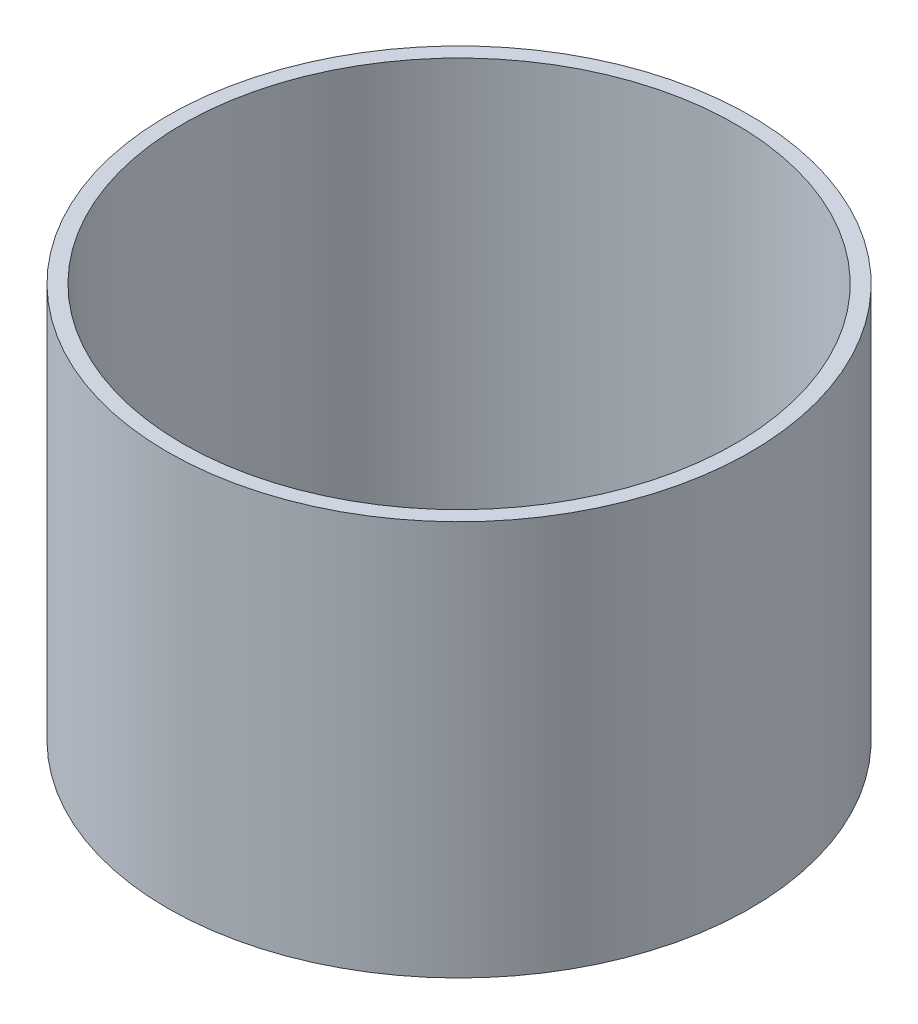
ISO-10303-21;
HEADER;
FILE_DESCRIPTION(('STEP AP214'),'2;1');
FILE_NAME('part.step','',(''),(''),'','','');
FILE_SCHEMA(('AUTOMOTIVE_DESIGN { 1 0 10303 214 1 1 1 1 }'));
ENDSEC;
DATA;
#1=APPLICATION_CONTEXT('core data for automotive mechanical design processes');
#2=APPLICATION_PROTOCOL_DEFINITION('international standard','automotive_design',2000,#1);
#3=PRODUCT_CONTEXT('',#1,'mechanical');
#4=PRODUCT('Part','Part','',(#3));
#5=PRODUCT_RELATED_PRODUCT_CATEGORY('part','',(#4));
#6=PRODUCT_DEFINITION_FORMATION('','',#4);
#7=PRODUCT_DEFINITION_CONTEXT('part definition',#1,'design');
#8=PRODUCT_DEFINITION('design','',#6,#7);
#9=PRODUCT_DEFINITION_SHAPE('','',#8);
#10=(LENGTH_UNIT() NAMED_UNIT(*) SI_UNIT(.MILLI.,.METRE.));
#11=(NAMED_UNIT(*) PLANE_ANGLE_UNIT() SI_UNIT($,.RADIAN.));
#12=(NAMED_UNIT(*) SI_UNIT($,.STERADIAN.) SOLID_ANGLE_UNIT());
#13=UNCERTAINTY_MEASURE_WITH_UNIT(LENGTH_MEASURE(1.E-05),#10,'distance_accuracy_value','');
#14=(GEOMETRIC_REPRESENTATION_CONTEXT(3) GLOBAL_UNCERTAINTY_ASSIGNED_CONTEXT((#13)) GLOBAL_UNIT_ASSIGNED_CONTEXT((#10,
#11,#12)) REPRESENTATION_CONTEXT('',''));
#15=CARTESIAN_POINT('',(0.,0.,0.));
#16=DIRECTION('',(0.,0.,1.));
#17=DIRECTION('',(1.,0.,0.));
#18=AXIS2_PLACEMENT_3D('',#15,#16,#17);
#19=CARTESIAN_POINT('',(0.,63.5,0.));
#20=DIRECTION('',(0.,1.,0.));
#21=DIRECTION('',(0.,0.,1.));
#22=AXIS2_PLACEMENT_3D('',#19,#20,#21);
#23=PLANE('',#22);
#24=CARTESIAN_POINT('',(0.,63.5,0.));
#25=DIRECTION('',(0.,1.,0.));
#26=DIRECTION('',(0.,0.,1.));
#27=AXIS2_PLACEMENT_3D('',#24,#25,#26);
#28=CIRCLE('',#27,93.6625);
#29=CARTESIAN_POINT('',(0.,63.5,93.6625));
#30=VERTEX_POINT('',#29);
#31=EDGE_CURVE('E10',#30,#30,#28,.T.);
#32=ORIENTED_EDGE('',*,*,#31,.T.);
#33=EDGE_LOOP('',(#32));
#34=FACE_BOUND('',#33,.T.);
#35=CARTESIAN_POINT('',(0.,63.5,0.));
#36=DIRECTION('',(0.,1.,0.));
#37=DIRECTION('',(0.,0.,1.));
#38=AXIS2_PLACEMENT_3D('',#35,#36,#37);
#39=CIRCLE('',#38,88.9);
#40=CARTESIAN_POINT('',(0.,63.5,88.9));
#41=VERTEX_POINT('',#40);
#42=EDGE_CURVE('E43',#41,#41,#39,.T.);
#43=ORIENTED_EDGE('',*,*,#42,.F.);
#44=EDGE_LOOP('',(#43));
#45=FACE_BOUND('',#44,.T.);
#46=ADVANCED_FACE('F32',(#34,#45),#23,.T.);
#47=CARTESIAN_POINT('',(0.,-63.5,0.));
#48=DIRECTION('',(0.,1.,0.));
#49=DIRECTION('',(0.,0.,1.));
#50=AXIS2_PLACEMENT_3D('',#47,#48,#49);
#51=PLANE('',#50);
#52=CARTESIAN_POINT('',(0.,-63.5,0.));
#53=DIRECTION('',(0.,1.,0.));
#54=DIRECTION('',(0.,0.,1.));
#55=AXIS2_PLACEMENT_3D('',#52,#53,#54);
#56=CIRCLE('',#55,93.6625);
#57=CARTESIAN_POINT('',(0.,-63.5,93.6625));
#58=VERTEX_POINT('',#57);
#59=EDGE_CURVE('E36',#58,#58,#56,.T.);
#60=ORIENTED_EDGE('',*,*,#59,.F.);
#61=EDGE_LOOP('',(#60));
#62=FACE_BOUND('',#61,.T.);
#63=CARTESIAN_POINT('',(0.,-63.5,0.));
#64=DIRECTION('',(0.,1.,0.));
#65=DIRECTION('',(0.,0.,1.));
#66=AXIS2_PLACEMENT_3D('',#63,#64,#65);
#67=CIRCLE('',#66,88.9);
#68=CARTESIAN_POINT('',(0.,-63.5,88.9));
#69=VERTEX_POINT('',#68);
#70=EDGE_CURVE('E45',#69,#69,#67,.T.);
#71=ORIENTED_EDGE('',*,*,#70,.T.);
#72=EDGE_LOOP('',(#71));
#73=FACE_BOUND('',#72,.T.);
#74=ADVANCED_FACE('F55',(#62,#73),#51,.F.);
#75=CARTESIAN_POINT('',(0.,63.5,0.));
#76=DIRECTION('',(0.,-1.,0.));
#77=DIRECTION('',(0.,0.,-1.));
#78=AXIS2_PLACEMENT_3D('',#75,#76,#77);
#79=CYLINDRICAL_SURFACE('',#78,93.6625);
#80=ORIENTED_EDGE('',*,*,#31,.F.);
#81=EDGE_LOOP('',(#80));
#82=FACE_BOUND('',#81,.T.);
#83=ORIENTED_EDGE('',*,*,#59,.T.);
#84=EDGE_LOOP('',(#83));
#85=FACE_BOUND('',#84,.T.);
#86=ADVANCED_FACE('F34',(#82,#85),#79,.T.);
#87=CARTESIAN_POINT('',(0.,63.5,0.));
#88=DIRECTION('',(0.,-1.,0.));
#89=DIRECTION('',(0.,0.,-1.));
#90=AXIS2_PLACEMENT_3D('',#87,#88,#89);
#91=CYLINDRICAL_SURFACE('',#90,88.9);
#92=ORIENTED_EDGE('',*,*,#42,.T.);
#93=EDGE_LOOP('',(#92));
#94=FACE_BOUND('',#93,.T.);
#95=ORIENTED_EDGE('',*,*,#70,.F.);
#96=EDGE_LOOP('',(#95));
#97=FACE_BOUND('',#96,.T.);
#98=ADVANCED_FACE('F51',(#94,#97),#91,.F.);
#99=CLOSED_SHELL('',(#46,#74,#86,#98));
#100=MANIFOLD_SOLID_BREP('B2',#99);
#101=ADVANCED_BREP_SHAPE_REPRESENTATION('',(#18,#100),#14);
#102=SHAPE_DEFINITION_REPRESENTATION(#9,#101);
ENDSEC;
END-ISO-10303-21;
